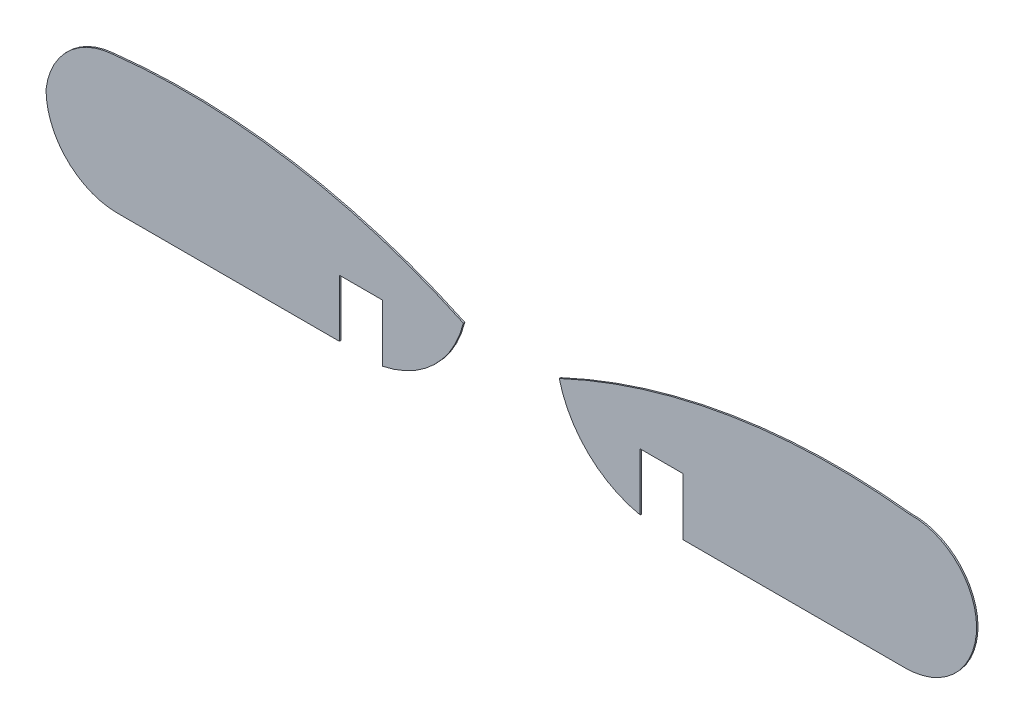
ISO-10303-21;
HEADER;
FILE_DESCRIPTION(('STEP AP214'),'2;1');
FILE_NAME('part.step','',(''),(''),'','','');
FILE_SCHEMA(('AUTOMOTIVE_DESIGN { 1 0 10303 214 1 1 1 1 }'));
ENDSEC;
DATA;
#1=APPLICATION_CONTEXT('core data for automotive mechanical design processes');
#2=APPLICATION_PROTOCOL_DEFINITION('international standard','automotive_design',2000,#1);
#3=PRODUCT_CONTEXT('',#1,'mechanical');
#4=PRODUCT('Part','Part','',(#3));
#5=PRODUCT_RELATED_PRODUCT_CATEGORY('part','',(#4));
#6=PRODUCT_DEFINITION_FORMATION('','',#4);
#7=PRODUCT_DEFINITION_CONTEXT('part definition',#1,'design');
#8=PRODUCT_DEFINITION('design','',#6,#7);
#9=PRODUCT_DEFINITION_SHAPE('','',#8);
#10=(LENGTH_UNIT() NAMED_UNIT(*) SI_UNIT(.MILLI.,.METRE.));
#11=(NAMED_UNIT(*) PLANE_ANGLE_UNIT() SI_UNIT($,.RADIAN.));
#12=(NAMED_UNIT(*) SI_UNIT($,.STERADIAN.) SOLID_ANGLE_UNIT());
#13=UNCERTAINTY_MEASURE_WITH_UNIT(LENGTH_MEASURE(1.E-05),#10,'distance_accuracy_value','');
#14=(GEOMETRIC_REPRESENTATION_CONTEXT(3) GLOBAL_UNCERTAINTY_ASSIGNED_CONTEXT((#13)) GLOBAL_UNIT_ASSIGNED_CONTEXT((#10,
#11,#12)) REPRESENTATION_CONTEXT('',''));
#15=CARTESIAN_POINT('',(0.,0.,0.));
#16=DIRECTION('',(0.,0.,1.));
#17=DIRECTION('',(1.,0.,0.));
#18=AXIS2_PLACEMENT_3D('',#15,#16,#17);
#19=CARTESIAN_POINT('',(50.7981960525181,-27.7402552319999,0.1));
#20=DIRECTION('',(0.,0.,-1.));
#21=DIRECTION('',(-1.,0.,0.));
#22=AXIS2_PLACEMENT_3D('',#19,#20,#21);
#23=CYLINDRICAL_SURFACE('',#22,5.00000000000001);
#24=CARTESIAN_POINT('',(50.7981960525181,-27.7402552319999,0.));
#25=DIRECTION('',(0.,0.,1.));
#26=DIRECTION('',(1.,0.,0.));
#27=AXIS2_PLACEMENT_3D('',#24,#25,#26);
#28=CIRCLE('',#27,5.00000000000001);
#29=CARTESIAN_POINT('',(50.7981960525181,-32.7402552319999,0.));
#30=VERTEX_POINT('',#29);
#31=CARTESIAN_POINT('',(55.6860268462482,-28.7933982098831,0.));
#32=VERTEX_POINT('',#31);
#33=EDGE_CURVE('E139',#30,#32,#28,.T.);
#34=ORIENTED_EDGE('',*,*,#33,.T.);
#35=DIRECTION('',(0.,0.,-1.));
#36=VECTOR('',#35,1.);
#37=CARTESIAN_POINT('',(55.6860268462482,-28.7933982098831,0.1));
#38=LINE('',#37,#36);
#39=CARTESIAN_POINT('',(55.6860268462482,-28.7933982098831,0.1));
#40=VERTEX_POINT('',#39);
#41=EDGE_CURVE('E12',#40,#32,#38,.T.);
#42=ORIENTED_EDGE('',*,*,#41,.F.);
#43=CARTESIAN_POINT('',(50.7981960525181,-27.7402552319999,0.1));
#44=DIRECTION('',(0.,0.,1.));
#45=DIRECTION('',(1.,0.,0.));
#46=AXIS2_PLACEMENT_3D('',#43,#44,#45);
#47=CIRCLE('',#46,5.00000000000001);
#48=CARTESIAN_POINT('',(50.7981960525181,-32.7402552319999,0.1));
#49=VERTEX_POINT('',#48);
#50=EDGE_CURVE('E153',#49,#40,#47,.T.);
#51=ORIENTED_EDGE('',*,*,#50,.F.);
#52=DIRECTION('',(0.,0.,-1.));
#53=VECTOR('',#52,1.);
#54=CARTESIAN_POINT('',(50.7981960525181,-32.7402552319999,0.1));
#55=LINE('',#54,#53);
#56=EDGE_CURVE('E135',#49,#30,#55,.T.);
#57=ORIENTED_EDGE('',*,*,#56,.T.);
#58=EDGE_LOOP('',(#34,#42,#51,#57));
#59=FACE_BOUND('',#58,.T.);
#60=ADVANCED_FACE('F43',(#59),#23,.T.);
#61=CARTESIAN_POINT('',(51.286347360834,-27.7952117033573,0.1));
#62=DIRECTION('',(0.,0.,-1.));
#63=DIRECTION('',(-1.,0.,0.));
#64=AXIS2_PLACEMENT_3D('',#61,#62,#63);
#65=CYLINDRICAL_SURFACE('',#64,4.51149153564364);
#66=CARTESIAN_POINT('',(51.286347360834,-27.7952117033573,0.));
#67=DIRECTION('',(0.,0.,1.));
#68=DIRECTION('',(1.,0.,0.));
#69=AXIS2_PLACEMENT_3D('',#66,#67,#68);
#70=CIRCLE('',#69,4.51149153564364);
#71=CARTESIAN_POINT('',(51.1333383972024,-23.2863155930845,0.));
#72=VERTEX_POINT('',#71);
#73=EDGE_CURVE('E142',#32,#72,#70,.T.);
#74=ORIENTED_EDGE('',*,*,#73,.T.);
#75=DIRECTION('',(0.,0.,-1.));
#76=VECTOR('',#75,1.);
#77=CARTESIAN_POINT('',(51.1333383972024,-23.2863155930845,0.1));
#78=LINE('',#77,#76);
#79=CARTESIAN_POINT('',(51.1333383972024,-23.2863155930845,0.1));
#80=VERTEX_POINT('',#79);
#81=EDGE_CURVE('E51',#80,#72,#78,.T.);
#82=ORIENTED_EDGE('',*,*,#81,.F.);
#83=CARTESIAN_POINT('',(51.286347360834,-27.7952117033573,0.1));
#84=DIRECTION('',(0.,0.,1.));
#85=DIRECTION('',(1.,0.,0.));
#86=AXIS2_PLACEMENT_3D('',#83,#84,#85);
#87=CIRCLE('',#86,4.51149153564364);
#88=EDGE_CURVE('E102',#40,#80,#87,.T.);
#89=ORIENTED_EDGE('',*,*,#88,.F.);
#90=ORIENTED_EDGE('',*,*,#41,.T.);
#91=EDGE_LOOP('',(#74,#82,#89,#90));
#92=FACE_BOUND('',#91,.T.);
#93=ADVANCED_FACE('F188',(#92),#65,.T.);
#94=CARTESIAN_POINT('',(46.0008550437127,-68.5880893068659,0.1));
#95=DIRECTION('',(0.,0.,-1.));
#96=DIRECTION('',(-1.,0.,0.));
#97=AXIS2_PLACEMENT_3D('',#94,#95,#96);
#98=CYLINDRICAL_SURFACE('',#97,45.5915900905913);
#99=CARTESIAN_POINT('',(46.0008550437127,-68.5880893068659,0.));
#100=DIRECTION('',(0.,0.,1.));
#101=DIRECTION('',(1.,0.,0.));
#102=AXIS2_PLACEMENT_3D('',#99,#100,#101);
#103=CIRCLE('',#102,45.5915900905913);
#104=CARTESIAN_POINT('',(26.6467671979538,-27.308404586084,0.));
#105=VERTEX_POINT('',#104);
#106=EDGE_CURVE('E144',#72,#105,#103,.T.);
#107=ORIENTED_EDGE('',*,*,#106,.T.);
#108=DIRECTION('',(0.,0.,-1.));
#109=VECTOR('',#108,1.);
#110=CARTESIAN_POINT('',(26.6467671979538,-27.308404586084,0.1));
#111=LINE('',#110,#109);
#112=CARTESIAN_POINT('',(26.6467671979538,-27.308404586084,0.1));
#113=VERTEX_POINT('',#112);
#114=EDGE_CURVE('E160',#113,#105,#111,.T.);
#115=ORIENTED_EDGE('',*,*,#114,.F.);
#116=CARTESIAN_POINT('',(46.0008550437127,-68.5880893068659,0.1));
#117=DIRECTION('',(0.,0.,1.));
#118=DIRECTION('',(1.,0.,0.));
#119=AXIS2_PLACEMENT_3D('',#116,#117,#118);
#120=CIRCLE('',#119,45.5915900905913);
#121=EDGE_CURVE('E168',#80,#113,#120,.T.);
#122=ORIENTED_EDGE('',*,*,#121,.F.);
#123=ORIENTED_EDGE('',*,*,#81,.T.);
#124=EDGE_LOOP('',(#107,#115,#122,#123));
#125=FACE_BOUND('',#124,.T.);
#126=ADVANCED_FACE('F166',(#125),#98,.T.);
#127=CARTESIAN_POINT('',(33.7762605152289,-25.546605373468,0.1));
#128=DIRECTION('',(0.,0.,-1.));
#129=DIRECTION('',(-1.,0.,0.));
#130=AXIS2_PLACEMENT_3D('',#127,#128,#129);
#131=CYLINDRICAL_SURFACE('',#130,7.34395066885964);
#132=CARTESIAN_POINT('',(33.7762605152289,-25.546605373468,0.));
#133=DIRECTION('',(0.,0.,1.));
#134=DIRECTION('',(1.,0.,0.));
#135=AXIS2_PLACEMENT_3D('',#132,#133,#134);
#136=CIRCLE('',#135,7.34395066885964);
#137=CARTESIAN_POINT('',(32.2980815208278,-32.7402552319999,0.));
#138=VERTEX_POINT('',#137);
#139=EDGE_CURVE('E146',#105,#138,#136,.T.);
#140=ORIENTED_EDGE('',*,*,#139,.T.);
#141=DIRECTION('',(0.,0.,-1.));
#142=VECTOR('',#141,1.);
#143=CARTESIAN_POINT('',(32.2980815208278,-32.7402552319999,0.1));
#144=LINE('',#143,#142);
#145=CARTESIAN_POINT('',(32.2980815208278,-32.7402552319999,0.1));
#146=VERTEX_POINT('',#145);
#147=EDGE_CURVE('E157',#146,#138,#144,.T.);
#148=ORIENTED_EDGE('',*,*,#147,.F.);
#149=CARTESIAN_POINT('',(33.7762605152289,-25.546605373468,0.1));
#150=DIRECTION('',(0.,0.,1.));
#151=DIRECTION('',(1.,0.,0.));
#152=AXIS2_PLACEMENT_3D('',#149,#150,#151);
#153=CIRCLE('',#152,7.34395066885964);
#154=EDGE_CURVE('E180',#113,#146,#153,.T.);
#155=ORIENTED_EDGE('',*,*,#154,.F.);
#156=ORIENTED_EDGE('',*,*,#114,.T.);
#157=EDGE_LOOP('',(#140,#148,#155,#156));
#158=FACE_BOUND('',#157,.T.);
#159=ADVANCED_FACE('F176',(#158),#131,.T.);
#160=CARTESIAN_POINT('',(32.2980815208278,-32.7402552319999,0.1));
#161=DIRECTION('',(-1.,0.,0.));
#162=DIRECTION('',(0.,0.,1.));
#163=AXIS2_PLACEMENT_3D('',#160,#161,#162);
#164=PLANE('',#163);
#165=DIRECTION('',(0.,1.,0.));
#166=VECTOR('',#165,1.);
#167=CARTESIAN_POINT('',(32.2980815208278,-32.7402552319999,0.));
#168=LINE('',#167,#166);
#169=CARTESIAN_POINT('',(32.2980815208278,-28.7402552319999,0.));
#170=VERTEX_POINT('',#169);
#171=EDGE_CURVE('E148',#138,#170,#168,.T.);
#172=ORIENTED_EDGE('',*,*,#171,.T.);
#173=DIRECTION('',(0.,0.,-1.));
#174=VECTOR('',#173,1.);
#175=CARTESIAN_POINT('',(32.2980815208278,-28.7402552319999,0.1));
#176=LINE('',#175,#174);
#177=CARTESIAN_POINT('',(32.2980815208278,-28.7402552319999,0.1));
#178=VERTEX_POINT('',#177);
#179=EDGE_CURVE('E130',#178,#170,#176,.T.);
#180=ORIENTED_EDGE('',*,*,#179,.F.);
#181=DIRECTION('',(0.,1.,0.));
#182=VECTOR('',#181,1.);
#183=CARTESIAN_POINT('',(32.2980815208278,-32.7402552319999,0.1));
#184=LINE('',#183,#182);
#185=EDGE_CURVE('E121',#146,#178,#184,.T.);
#186=ORIENTED_EDGE('',*,*,#185,.F.);
#187=ORIENTED_EDGE('',*,*,#147,.T.);
#188=EDGE_LOOP('',(#172,#180,#186,#187));
#189=FACE_BOUND('',#188,.T.);
#190=ADVANCED_FACE('F179',(#189),#164,.F.);
#191=CARTESIAN_POINT('',(32.2980815208278,-28.7402552319999,0.1));
#192=DIRECTION('',(0.,1.,0.));
#193=DIRECTION('',(0.,0.,1.));
#194=AXIS2_PLACEMENT_3D('',#191,#192,#193);
#195=PLANE('',#194);
#196=DIRECTION('',(1.,0.,0.));
#197=VECTOR('',#196,1.);
#198=CARTESIAN_POINT('',(32.2980815208278,-28.7402552319999,0.));
#199=LINE('',#198,#197);
#200=CARTESIAN_POINT('',(35.2980815208278,-28.7402552319999,0.));
#201=VERTEX_POINT('',#200);
#202=EDGE_CURVE('E129',#170,#201,#199,.T.);
#203=ORIENTED_EDGE('',*,*,#202,.T.);
#204=DIRECTION('',(0.,0.,-1.));
#205=VECTOR('',#204,1.);
#206=CARTESIAN_POINT('',(35.2980815208278,-28.7402552319999,0.1));
#207=LINE('',#206,#205);
#208=CARTESIAN_POINT('',(35.2980815208278,-28.7402552319999,0.1));
#209=VERTEX_POINT('',#208);
#210=EDGE_CURVE('E126',#209,#201,#207,.T.);
#211=ORIENTED_EDGE('',*,*,#210,.F.);
#212=DIRECTION('',(1.,0.,0.));
#213=VECTOR('',#212,1.);
#214=CARTESIAN_POINT('',(32.2980815208278,-28.7402552319999,0.1));
#215=LINE('',#214,#213);
#216=EDGE_CURVE('E115',#178,#209,#215,.T.);
#217=ORIENTED_EDGE('',*,*,#216,.F.);
#218=ORIENTED_EDGE('',*,*,#179,.T.);
#219=EDGE_LOOP('',(#203,#211,#217,#218));
#220=FACE_BOUND('',#219,.T.);
#221=ADVANCED_FACE('F127',(#220),#195,.F.);
#222=CARTESIAN_POINT('',(35.2980815208278,-28.7402552319999,0.1));
#223=DIRECTION('',(1.,0.,0.));
#224=DIRECTION('',(0.,0.,-1.));
#225=AXIS2_PLACEMENT_3D('',#222,#223,#224);
#226=PLANE('',#225);
#227=DIRECTION('',(0.,-1.,0.));
#228=VECTOR('',#227,1.);
#229=CARTESIAN_POINT('',(35.2980815208278,-28.7402552319999,0.));
#230=LINE('',#229,#228);
#231=CARTESIAN_POINT('',(35.2980815208278,-32.7402552319999,0.));
#232=VERTEX_POINT('',#231);
#233=EDGE_CURVE('E88',#201,#232,#230,.T.);
#234=ORIENTED_EDGE('',*,*,#233,.T.);
#235=DIRECTION('',(0.,0.,-1.));
#236=VECTOR('',#235,1.);
#237=CARTESIAN_POINT('',(35.2980815208278,-32.7402552319999,0.1));
#238=LINE('',#237,#236);
#239=CARTESIAN_POINT('',(35.2980815208278,-32.7402552319999,0.1));
#240=VERTEX_POINT('',#239);
#241=EDGE_CURVE('E131',#240,#232,#238,.T.);
#242=ORIENTED_EDGE('',*,*,#241,.F.);
#243=DIRECTION('',(0.,-1.,0.));
#244=VECTOR('',#243,1.);
#245=CARTESIAN_POINT('',(35.2980815208278,-28.7402552319999,0.1));
#246=LINE('',#245,#244);
#247=EDGE_CURVE('E119',#209,#240,#246,.T.);
#248=ORIENTED_EDGE('',*,*,#247,.F.);
#249=ORIENTED_EDGE('',*,*,#210,.T.);
#250=EDGE_LOOP('',(#234,#242,#248,#249));
#251=FACE_BOUND('',#250,.T.);
#252=ADVANCED_FACE('F133',(#251),#226,.F.);
#253=CARTESIAN_POINT('',(35.2980815208278,-32.7402552319999,0.1));
#254=DIRECTION('',(0.,1.,0.));
#255=DIRECTION('',(0.,0.,1.));
#256=AXIS2_PLACEMENT_3D('',#253,#254,#255);
#257=PLANE('',#256);
#258=DIRECTION('',(1.,0.,0.));
#259=VECTOR('',#258,1.);
#260=CARTESIAN_POINT('',(35.2980815208278,-32.7402552319999,0.));
#261=LINE('',#260,#259);
#262=EDGE_CURVE('E94',#232,#30,#261,.T.);
#263=ORIENTED_EDGE('',*,*,#262,.T.);
#264=ORIENTED_EDGE('',*,*,#56,.F.);
#265=DIRECTION('',(1.,0.,0.));
#266=VECTOR('',#265,1.);
#267=CARTESIAN_POINT('',(35.2980815208278,-32.7402552319999,0.1));
#268=LINE('',#267,#266);
#269=EDGE_CURVE('E59',#240,#49,#268,.T.);
#270=ORIENTED_EDGE('',*,*,#269,.F.);
#271=ORIENTED_EDGE('',*,*,#241,.T.);
#272=EDGE_LOOP('',(#263,#264,#270,#271));
#273=FACE_BOUND('',#272,.T.);
#274=ADVANCED_FACE('F204',(#273),#257,.F.);
#275=CARTESIAN_POINT('',(50.7981960525181,-27.7402552319999,0.1));
#276=DIRECTION('',(0.,0.,1.));
#277=DIRECTION('',(1.,0.,0.));
#278=AXIS2_PLACEMENT_3D('',#275,#276,#277);
#279=PLANE('',#278);
#280=ORIENTED_EDGE('',*,*,#50,.T.);
#281=ORIENTED_EDGE('',*,*,#88,.T.);
#282=ORIENTED_EDGE('',*,*,#121,.T.);
#283=ORIENTED_EDGE('',*,*,#154,.T.);
#284=ORIENTED_EDGE('',*,*,#185,.T.);
#285=ORIENTED_EDGE('',*,*,#216,.T.);
#286=ORIENTED_EDGE('',*,*,#247,.T.);
#287=ORIENTED_EDGE('',*,*,#269,.T.);
#288=EDGE_LOOP('',(#280,#281,#282,#283,#284,#285,#286,#287));
#289=FACE_BOUND('',#288,.T.);
#290=ADVANCED_FACE('F117',(#289),#279,.T.);
#291=CARTESIAN_POINT('',(50.7981960525181,-27.7402552319999,0.));
#292=DIRECTION('',(0.,0.,1.));
#293=DIRECTION('',(1.,0.,0.));
#294=AXIS2_PLACEMENT_3D('',#291,#292,#293);
#295=PLANE('',#294);
#296=ORIENTED_EDGE('',*,*,#33,.F.);
#297=ORIENTED_EDGE('',*,*,#262,.F.);
#298=ORIENTED_EDGE('',*,*,#233,.F.);
#299=ORIENTED_EDGE('',*,*,#202,.F.);
#300=ORIENTED_EDGE('',*,*,#171,.F.);
#301=ORIENTED_EDGE('',*,*,#139,.F.);
#302=ORIENTED_EDGE('',*,*,#106,.F.);
#303=ORIENTED_EDGE('',*,*,#73,.F.);
#304=EDGE_LOOP('',(#296,#297,#298,#299,#300,#301,#302,#303));
#305=FACE_BOUND('',#304,.T.);
#306=ADVANCED_FACE('F172',(#305),#295,.F.);
#307=CLOSED_SHELL('',(#60,#93,#126,#159,#190,#221,#252,#274,#290,#306));
#308=MANIFOLD_SOLID_BREP('B2',#307);
#309=CARTESIAN_POINT('',(12.8199025264269,-25.546605373468,0.1));
#310=DIRECTION('',(0.,0.,-1.));
#311=DIRECTION('',(-1.,0.,0.));
#312=AXIS2_PLACEMENT_3D('',#309,#310,#311);
#313=CYLINDRICAL_SURFACE('',#312,7.34395066885963);
#314=CARTESIAN_POINT('',(12.8199025264269,-25.546605373468,0.));
#315=DIRECTION('',(0.,0.,1.));
#316=DIRECTION('',(1.,0.,0.));
#317=AXIS2_PLACEMENT_3D('',#314,#315,#316);
#318=CIRCLE('',#317,7.34395066885963);
#319=CARTESIAN_POINT('',(14.2980815208279,-32.7402552319999,0.));
#320=VERTEX_POINT('',#319);
#321=CARTESIAN_POINT('',(19.9493958437019,-27.3084045860841,0.));
#322=VERTEX_POINT('',#321);
#323=EDGE_CURVE('E367',#320,#322,#318,.T.);
#324=ORIENTED_EDGE('',*,*,#323,.T.);
#325=DIRECTION('',(0.,0.,-1.));
#326=VECTOR('',#325,1.);
#327=CARTESIAN_POINT('',(19.9493958437019,-27.3084045860841,0.1));
#328=LINE('',#327,#326);
#329=CARTESIAN_POINT('',(19.9493958437019,-27.3084045860841,0.1));
#330=VERTEX_POINT('',#329);
#331=EDGE_CURVE('E41',#330,#322,#328,.T.);
#332=ORIENTED_EDGE('',*,*,#331,.F.);
#333=CARTESIAN_POINT('',(12.8199025264269,-25.546605373468,0.1));
#334=DIRECTION('',(0.,0.,1.));
#335=DIRECTION('',(1.,0.,0.));
#336=AXIS2_PLACEMENT_3D('',#333,#334,#335);
#337=CIRCLE('',#336,7.34395066885963);
#338=CARTESIAN_POINT('',(14.2980815208279,-32.7402552319999,0.1));
#339=VERTEX_POINT('',#338);
#340=EDGE_CURVE('E381',#339,#330,#337,.T.);
#341=ORIENTED_EDGE('',*,*,#340,.F.);
#342=DIRECTION('',(0.,0.,-1.));
#343=VECTOR('',#342,1.);
#344=CARTESIAN_POINT('',(14.2980815208279,-32.7402552319999,0.1));
#345=LINE('',#344,#343);
#346=EDGE_CURVE('E363',#339,#320,#345,.T.);
#347=ORIENTED_EDGE('',*,*,#346,.T.);
#348=EDGE_LOOP('',(#324,#332,#341,#347));
#349=FACE_BOUND('',#348,.T.);
#350=ADVANCED_FACE('F271',(#349),#313,.T.);
#351=CARTESIAN_POINT('',(0.595307997942989,-68.5880893068659,0.1));
#352=DIRECTION('',(0.,0.,-1.));
#353=DIRECTION('',(-1.,0.,0.));
#354=AXIS2_PLACEMENT_3D('',#351,#352,#353);
#355=CYLINDRICAL_SURFACE('',#354,45.5915900905913);
#356=CARTESIAN_POINT('',(0.595307997942989,-68.5880893068659,0.));
#357=DIRECTION('',(0.,0.,1.));
#358=DIRECTION('',(1.,0.,0.));
#359=AXIS2_PLACEMENT_3D('',#356,#357,#358);
#360=CIRCLE('',#359,45.5915900905913);
#361=CARTESIAN_POINT('',(-4.53717535554675,-23.2863155930845,0.));
#362=VERTEX_POINT('',#361);
#363=EDGE_CURVE('E370',#322,#362,#360,.T.);
#364=ORIENTED_EDGE('',*,*,#363,.T.);
#365=DIRECTION('',(0.,0.,-1.));
#366=VECTOR('',#365,1.);
#367=CARTESIAN_POINT('',(-4.53717535554675,-23.2863155930845,0.1));
#368=LINE('',#367,#366);
#369=CARTESIAN_POINT('',(-4.53717535554675,-23.2863155930845,0.1));
#370=VERTEX_POINT('',#369);
#371=EDGE_CURVE('E279',#370,#362,#368,.T.);
#372=ORIENTED_EDGE('',*,*,#371,.F.);
#373=CARTESIAN_POINT('',(0.595307997942989,-68.5880893068659,0.1));
#374=DIRECTION('',(0.,0.,1.));
#375=DIRECTION('',(1.,0.,0.));
#376=AXIS2_PLACEMENT_3D('',#373,#374,#375);
#377=CIRCLE('',#376,45.5915900905913);
#378=EDGE_CURVE('E330',#330,#370,#377,.T.);
#379=ORIENTED_EDGE('',*,*,#378,.F.);
#380=ORIENTED_EDGE('',*,*,#331,.T.);
#381=EDGE_LOOP('',(#364,#372,#379,#380));
#382=FACE_BOUND('',#381,.T.);
#383=ADVANCED_FACE('F416',(#382),#355,.T.);
#384=CARTESIAN_POINT('',(-4.15264168458327,-28.3589266843113,0.1));
#385=DIRECTION('',(0.,0.,-1.));
#386=DIRECTION('',(-1.,0.,0.));
#387=AXIS2_PLACEMENT_3D('',#384,#385,#386);
#388=CYLINDRICAL_SURFACE('',#387,5.08716516607642);
#389=CARTESIAN_POINT('',(-4.15264168458327,-28.3589266843113,0.));
#390=DIRECTION('',(0.,0.,1.));
#391=DIRECTION('',(1.,0.,0.));
#392=AXIS2_PLACEMENT_3D('',#389,#390,#391);
#393=CIRCLE('',#392,5.08716516607642);
#394=CARTESIAN_POINT('',(-9.20203300953988,-27.740140231329,0.));
#395=VERTEX_POINT('',#394);
#396=EDGE_CURVE('E372',#362,#395,#393,.T.);
#397=ORIENTED_EDGE('',*,*,#396,.T.);
#398=DIRECTION('',(0.,0.,-1.));
#399=VECTOR('',#398,1.);
#400=CARTESIAN_POINT('',(-9.20203300953988,-27.740140231329,0.1));
#401=LINE('',#400,#399);
#402=CARTESIAN_POINT('',(-9.20203300953988,-27.740140231329,0.1));
#403=VERTEX_POINT('',#402);
#404=EDGE_CURVE('E388',#403,#395,#401,.T.);
#405=ORIENTED_EDGE('',*,*,#404,.F.);
#406=CARTESIAN_POINT('',(-4.15264168458327,-28.3589266843113,0.1));
#407=DIRECTION('',(0.,0.,1.));
#408=DIRECTION('',(1.,0.,0.));
#409=AXIS2_PLACEMENT_3D('',#406,#407,#408);
#410=CIRCLE('',#409,5.08716516607642);
#411=EDGE_CURVE('E396',#370,#403,#410,.T.);
#412=ORIENTED_EDGE('',*,*,#411,.F.);
#413=ORIENTED_EDGE('',*,*,#371,.T.);
#414=EDGE_LOOP('',(#397,#405,#412,#413));
#415=FACE_BOUND('',#414,.T.);
#416=ADVANCED_FACE('F394',(#415),#388,.T.);
#417=CARTESIAN_POINT('',(-4.20203301086238,-27.7402552319999,0.1));
#418=DIRECTION('',(0.,0.,-1.));
#419=DIRECTION('',(-1.,0.,0.));
#420=AXIS2_PLACEMENT_3D('',#417,#418,#419);
#421=CYLINDRICAL_SURFACE('',#420,5.00000000000001);
#422=CARTESIAN_POINT('',(-4.20203301086238,-27.7402552319999,0.));
#423=DIRECTION('',(0.,0.,1.));
#424=DIRECTION('',(1.,0.,0.));
#425=AXIS2_PLACEMENT_3D('',#422,#423,#424);
#426=CIRCLE('',#425,5.00000000000001);
#427=CARTESIAN_POINT('',(-4.20203301086239,-32.7402552319999,0.));
#428=VERTEX_POINT('',#427);
#429=EDGE_CURVE('E374',#395,#428,#426,.T.);
#430=ORIENTED_EDGE('',*,*,#429,.T.);
#431=DIRECTION('',(0.,0.,-1.));
#432=VECTOR('',#431,1.);
#433=CARTESIAN_POINT('',(-4.20203301086239,-32.7402552319999,0.1));
#434=LINE('',#433,#432);
#435=CARTESIAN_POINT('',(-4.20203301086239,-32.7402552319999,0.1));
#436=VERTEX_POINT('',#435);
#437=EDGE_CURVE('E385',#436,#428,#434,.T.);
#438=ORIENTED_EDGE('',*,*,#437,.F.);
#439=CARTESIAN_POINT('',(-4.20203301086238,-27.7402552319999,0.1));
#440=DIRECTION('',(0.,0.,1.));
#441=DIRECTION('',(1.,0.,0.));
#442=AXIS2_PLACEMENT_3D('',#439,#440,#441);
#443=CIRCLE('',#442,5.00000000000001);
#444=EDGE_CURVE('E408',#403,#436,#443,.T.);
#445=ORIENTED_EDGE('',*,*,#444,.F.);
#446=ORIENTED_EDGE('',*,*,#404,.T.);
#447=EDGE_LOOP('',(#430,#438,#445,#446));
#448=FACE_BOUND('',#447,.T.);
#449=ADVANCED_FACE('F404',(#448),#421,.T.);
#450=CARTESIAN_POINT('',(-4.20203301086239,-32.7402552319999,0.1));
#451=DIRECTION('',(0.,1.,0.));
#452=DIRECTION('',(-1.,0.,0.));
#453=AXIS2_PLACEMENT_3D('',#450,#451,#452);
#454=PLANE('',#453);
#455=DIRECTION('',(1.,0.,0.));
#456=VECTOR('',#455,1.);
#457=CARTESIAN_POINT('',(-4.20203301086239,-32.7402552319999,0.));
#458=LINE('',#457,#456);
#459=CARTESIAN_POINT('',(11.2980815208278,-32.7402552319999,0.));
#460=VERTEX_POINT('',#459);
#461=EDGE_CURVE('E376',#428,#460,#458,.T.);
#462=ORIENTED_EDGE('',*,*,#461,.T.);
#463=DIRECTION('',(0.,0.,-1.));
#464=VECTOR('',#463,1.);
#465=CARTESIAN_POINT('',(11.2980815208278,-32.7402552319999,0.1));
#466=LINE('',#465,#464);
#467=CARTESIAN_POINT('',(11.2980815208278,-32.7402552319999,0.1));
#468=VERTEX_POINT('',#467);
#469=EDGE_CURVE('E358',#468,#460,#466,.T.);
#470=ORIENTED_EDGE('',*,*,#469,.F.);
#471=DIRECTION('',(1.,0.,0.));
#472=VECTOR('',#471,1.);
#473=CARTESIAN_POINT('',(-4.20203301086239,-32.7402552319999,0.1));
#474=LINE('',#473,#472);
#475=EDGE_CURVE('E349',#436,#468,#474,.T.);
#476=ORIENTED_EDGE('',*,*,#475,.F.);
#477=ORIENTED_EDGE('',*,*,#437,.T.);
#478=EDGE_LOOP('',(#462,#470,#476,#477));
#479=FACE_BOUND('',#478,.T.);
#480=ADVANCED_FACE('F407',(#479),#454,.F.);
#481=CARTESIAN_POINT('',(11.2980815208278,-32.7402552319999,0.1));
#482=DIRECTION('',(-1.,0.,0.));
#483=DIRECTION('',(0.,-1.,0.));
#484=AXIS2_PLACEMENT_3D('',#481,#482,#483);
#485=PLANE('',#484);
#486=DIRECTION('',(0.,1.,0.));
#487=VECTOR('',#486,1.);
#488=CARTESIAN_POINT('',(11.2980815208278,-32.7402552319999,0.));
#489=LINE('',#488,#487);
#490=CARTESIAN_POINT('',(11.2980815208278,-28.7402552319999,0.));
#491=VERTEX_POINT('',#490);
#492=EDGE_CURVE('E357',#460,#491,#489,.T.);
#493=ORIENTED_EDGE('',*,*,#492,.T.);
#494=DIRECTION('',(0.,0.,-1.));
#495=VECTOR('',#494,1.);
#496=CARTESIAN_POINT('',(11.2980815208278,-28.7402552319999,0.1));
#497=LINE('',#496,#495);
#498=CARTESIAN_POINT('',(11.2980815208278,-28.7402552319999,0.1));
#499=VERTEX_POINT('',#498);
#500=EDGE_CURVE('E354',#499,#491,#497,.T.);
#501=ORIENTED_EDGE('',*,*,#500,.F.);
#502=DIRECTION('',(0.,1.,0.));
#503=VECTOR('',#502,1.);
#504=CARTESIAN_POINT('',(11.2980815208278,-32.7402552319999,0.1));
#505=LINE('',#504,#503);
#506=EDGE_CURVE('E343',#468,#499,#505,.T.);
#507=ORIENTED_EDGE('',*,*,#506,.F.);
#508=ORIENTED_EDGE('',*,*,#469,.T.);
#509=EDGE_LOOP('',(#493,#501,#507,#508));
#510=FACE_BOUND('',#509,.T.);
#511=ADVANCED_FACE('F355',(#510),#485,.F.);
#512=CARTESIAN_POINT('',(11.2980815208278,-28.7402552319999,0.1));
#513=DIRECTION('',(0.,1.,0.));
#514=DIRECTION('',(-1.,0.,0.));
#515=AXIS2_PLACEMENT_3D('',#512,#513,#514);
#516=PLANE('',#515);
#517=DIRECTION('',(1.,0.,0.));
#518=VECTOR('',#517,1.);
#519=CARTESIAN_POINT('',(11.2980815208278,-28.7402552319999,0.));
#520=LINE('',#519,#518);
#521=CARTESIAN_POINT('',(14.2980815208278,-28.7402552319999,0.));
#522=VERTEX_POINT('',#521);
#523=EDGE_CURVE('E316',#491,#522,#520,.T.);
#524=ORIENTED_EDGE('',*,*,#523,.T.);
#525=DIRECTION('',(0.,0.,-1.));
#526=VECTOR('',#525,1.);
#527=CARTESIAN_POINT('',(14.2980815208278,-28.7402552319999,0.1));
#528=LINE('',#527,#526);
#529=CARTESIAN_POINT('',(14.2980815208278,-28.7402552319999,0.1));
#530=VERTEX_POINT('',#529);
#531=EDGE_CURVE('E359',#530,#522,#528,.T.);
#532=ORIENTED_EDGE('',*,*,#531,.F.);
#533=DIRECTION('',(1.,0.,0.));
#534=VECTOR('',#533,1.);
#535=CARTESIAN_POINT('',(11.2980815208278,-28.7402552319999,0.1));
#536=LINE('',#535,#534);
#537=EDGE_CURVE('E347',#499,#530,#536,.T.);
#538=ORIENTED_EDGE('',*,*,#537,.F.);
#539=ORIENTED_EDGE('',*,*,#500,.T.);
#540=EDGE_LOOP('',(#524,#532,#538,#539));
#541=FACE_BOUND('',#540,.T.);
#542=ADVANCED_FACE('F361',(#541),#516,.F.);
#543=CARTESIAN_POINT('',(14.2980815208278,-28.7402552319999,0.1));
#544=DIRECTION('',(1.,0.,0.));
#545=DIRECTION('',(0.,1.,0.));
#546=AXIS2_PLACEMENT_3D('',#543,#544,#545);
#547=PLANE('',#546);
#548=DIRECTION('',(0.,-1.,0.));
#549=VECTOR('',#548,1.);
#550=CARTESIAN_POINT('',(14.2980815208278,-28.7402552319999,0.));
#551=LINE('',#550,#549);
#552=EDGE_CURVE('E322',#522,#320,#551,.T.);
#553=ORIENTED_EDGE('',*,*,#552,.T.);
#554=ORIENTED_EDGE('',*,*,#346,.F.);
#555=DIRECTION('',(0.,-1.,0.));
#556=VECTOR('',#555,1.);
#557=CARTESIAN_POINT('',(14.2980815208278,-28.7402552319999,0.1));
#558=LINE('',#557,#556);
#559=EDGE_CURVE('E287',#530,#339,#558,.T.);
#560=ORIENTED_EDGE('',*,*,#559,.F.);
#561=ORIENTED_EDGE('',*,*,#531,.T.);
#562=EDGE_LOOP('',(#553,#554,#560,#561));
#563=FACE_BOUND('',#562,.T.);
#564=ADVANCED_FACE('F432',(#563),#547,.F.);
#565=CARTESIAN_POINT('',(12.8199025264269,-25.546605373468,0.1));
#566=DIRECTION('',(0.,0.,1.));
#567=DIRECTION('',(1.,0.,0.));
#568=AXIS2_PLACEMENT_3D('',#565,#566,#567);
#569=PLANE('',#568);
#570=ORIENTED_EDGE('',*,*,#340,.T.);
#571=ORIENTED_EDGE('',*,*,#378,.T.);
#572=ORIENTED_EDGE('',*,*,#411,.T.);
#573=ORIENTED_EDGE('',*,*,#444,.T.);
#574=ORIENTED_EDGE('',*,*,#475,.T.);
#575=ORIENTED_EDGE('',*,*,#506,.T.);
#576=ORIENTED_EDGE('',*,*,#537,.T.);
#577=ORIENTED_EDGE('',*,*,#559,.T.);
#578=EDGE_LOOP('',(#570,#571,#572,#573,#574,#575,#576,#577));
#579=FACE_BOUND('',#578,.T.);
#580=ADVANCED_FACE('F345',(#579),#569,.T.);
#581=CARTESIAN_POINT('',(12.8199025264269,-25.546605373468,0.));
#582=DIRECTION('',(0.,0.,1.));
#583=DIRECTION('',(1.,0.,0.));
#584=AXIS2_PLACEMENT_3D('',#581,#582,#583);
#585=PLANE('',#584);
#586=ORIENTED_EDGE('',*,*,#323,.F.);
#587=ORIENTED_EDGE('',*,*,#552,.F.);
#588=ORIENTED_EDGE('',*,*,#523,.F.);
#589=ORIENTED_EDGE('',*,*,#492,.F.);
#590=ORIENTED_EDGE('',*,*,#461,.F.);
#591=ORIENTED_EDGE('',*,*,#429,.F.);
#592=ORIENTED_EDGE('',*,*,#396,.F.);
#593=ORIENTED_EDGE('',*,*,#363,.F.);
#594=EDGE_LOOP('',(#586,#587,#588,#589,#590,#591,#592,#593));
#595=FACE_BOUND('',#594,.T.);
#596=ADVANCED_FACE('F400',(#595),#585,.F.);
#597=CLOSED_SHELL('',(#350,#383,#416,#449,#480,#511,#542,#564,#580,#596));
#598=MANIFOLD_SOLID_BREP('B6',#597);
#599=ADVANCED_BREP_SHAPE_REPRESENTATION('',(#18,#308,#598),#14);
#600=SHAPE_DEFINITION_REPRESENTATION(#9,#599);
ENDSEC;
END-ISO-10303-21;
